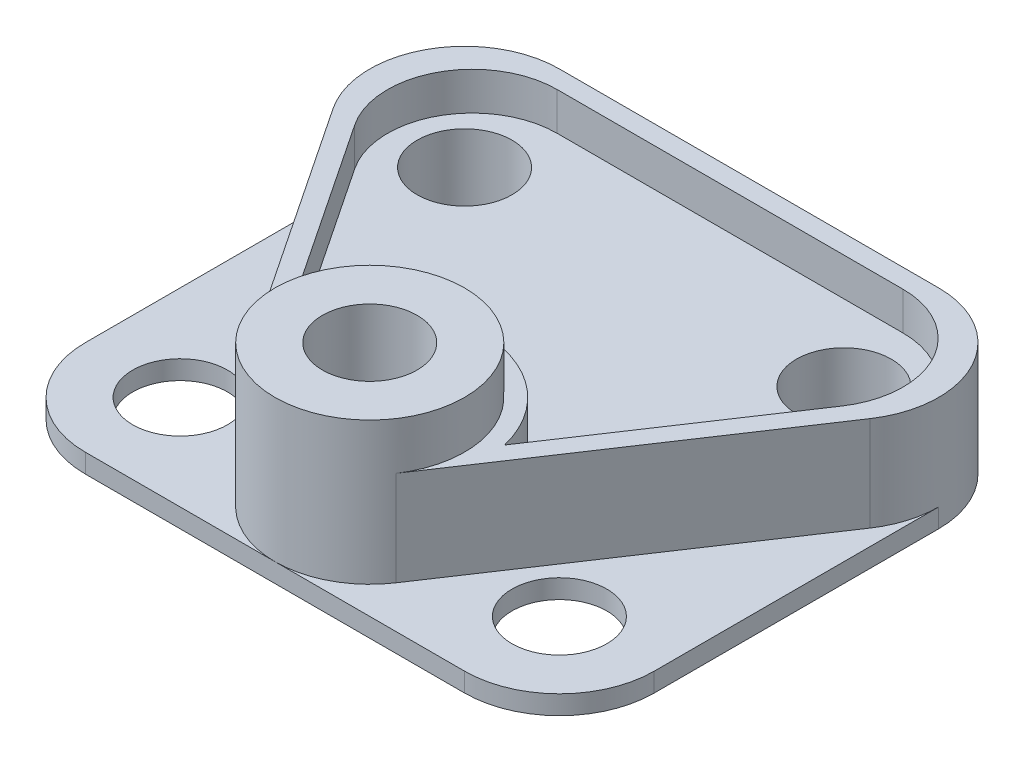
ISO-10303-21;
HEADER;
FILE_DESCRIPTION(('STEP AP214'),'2;1');
FILE_NAME('part.step','',(''),(''),'','','');
FILE_SCHEMA(('AUTOMOTIVE_DESIGN { 1 0 10303 214 1 1 1 1 }'));
ENDSEC;
DATA;
#1=APPLICATION_CONTEXT('core data for automotive mechanical design processes');
#2=APPLICATION_PROTOCOL_DEFINITION('international standard','automotive_design',2000,#1);
#3=PRODUCT_CONTEXT('',#1,'mechanical');
#4=PRODUCT('Part','Part','',(#3));
#5=PRODUCT_RELATED_PRODUCT_CATEGORY('part','',(#4));
#6=PRODUCT_DEFINITION_FORMATION('','',#4);
#7=PRODUCT_DEFINITION_CONTEXT('part definition',#1,'design');
#8=PRODUCT_DEFINITION('design','',#6,#7);
#9=PRODUCT_DEFINITION_SHAPE('','',#8);
#10=(LENGTH_UNIT() NAMED_UNIT(*) SI_UNIT(.MILLI.,.METRE.));
#11=(NAMED_UNIT(*) PLANE_ANGLE_UNIT() SI_UNIT($,.RADIAN.));
#12=(NAMED_UNIT(*) SI_UNIT($,.STERADIAN.) SOLID_ANGLE_UNIT());
#13=UNCERTAINTY_MEASURE_WITH_UNIT(LENGTH_MEASURE(1.E-05),#10,'distance_accuracy_value','');
#14=(GEOMETRIC_REPRESENTATION_CONTEXT(3) GLOBAL_UNCERTAINTY_ASSIGNED_CONTEXT((#13)) GLOBAL_UNIT_ASSIGNED_CONTEXT((#10,
#11,#12)) REPRESENTATION_CONTEXT('',''));
#15=CARTESIAN_POINT('',(0.,0.,0.));
#16=DIRECTION('',(0.,0.,1.));
#17=DIRECTION('',(1.,0.,0.));
#18=AXIS2_PLACEMENT_3D('',#15,#16,#17);
#19=CARTESIAN_POINT('',(12.7,2.54,-50.8));
#20=DIRECTION('',(0.,-1.,0.));
#21=DIRECTION('',(0.,0.,-1.));
#22=AXIS2_PLACEMENT_3D('',#19,#20,#21);
#23=PLANE('',#22);
#24=CARTESIAN_POINT('',(12.7,2.54,-12.7));
#25=DIRECTION('',(0.,1.,0.));
#26=DIRECTION('',(0.,0.,1.));
#27=AXIS2_PLACEMENT_3D('',#24,#25,#26);
#28=CIRCLE('',#27,6.35);
#29=CARTESIAN_POINT('',(12.7,2.54,-6.34999999999999));
#30=VERTEX_POINT('',#29);
#31=EDGE_CURVE('E274',#30,#30,#28,.T.);
#32=ORIENTED_EDGE('',*,*,#31,.F.);
#33=EDGE_LOOP('',(#32));
#34=FACE_BOUND('',#33,.T.);
#35=CARTESIAN_POINT('',(38.1,2.54,-12.7));
#36=DIRECTION('',(0.,1.,0.));
#37=DIRECTION('',(0.,0.,1.));
#38=AXIS2_PLACEMENT_3D('',#35,#36,#37);
#39=CIRCLE('',#38,12.7);
#40=CARTESIAN_POINT('',(27.5329612619094,2.54,-5.65530750793959));
#41=VERTEX_POINT('',#40);
#42=CARTESIAN_POINT('',(38.1,2.54,0.));
#43=VERTEX_POINT('',#42);
#44=EDGE_CURVE('E200',#41,#43,#39,.T.);
#45=ORIENTED_EDGE('',*,*,#44,.F.);
#46=DIRECTION('',(0.554700196225229,0.,0.832050294337844));
#47=VECTOR('',#46,1.);
#48=CARTESIAN_POINT('',(21.6714228003709,2.54,-14.4476152002473));
#49=LINE('',#48,#47);
#50=CARTESIAN_POINT('',(2.13296126190938,2.54,-43.7553075079396));
#51=VERTEX_POINT('',#50);
#52=EDGE_CURVE('E215',#51,#41,#49,.T.);
#53=ORIENTED_EDGE('',*,*,#52,.F.);
#54=CARTESIAN_POINT('',(12.7,2.54,-50.8));
#55=DIRECTION('',(0.,1.,0.));
#56=DIRECTION('',(0.,0.,1.));
#57=AXIS2_PLACEMENT_3D('',#54,#55,#56);
#58=CIRCLE('',#57,12.7);
#59=CARTESIAN_POINT('',(0.,2.54,-50.8));
#60=VERTEX_POINT('',#59);
#61=EDGE_CURVE('E11',#60,#51,#58,.T.);
#62=ORIENTED_EDGE('',*,*,#61,.F.);
#63=DIRECTION('',(0.,0.,1.));
#64=VECTOR('',#63,1.);
#65=CARTESIAN_POINT('',(0.,2.54,-12.7000000000001));
#66=LINE('',#65,#64);
#67=CARTESIAN_POINT('',(0.,2.54,-12.7000000000001));
#68=VERTEX_POINT('',#67);
#69=EDGE_CURVE('E280',#60,#68,#66,.T.);
#70=ORIENTED_EDGE('',*,*,#69,.T.);
#71=CARTESIAN_POINT('',(12.7,2.54,-12.7));
#72=DIRECTION('',(0.,1.,0.));
#73=DIRECTION('',(0.,0.,-1.));
#74=AXIS2_PLACEMENT_3D('',#71,#72,#73);
#75=CIRCLE('',#74,12.7);
#76=CARTESIAN_POINT('',(12.7000000000001,2.54,0.));
#77=VERTEX_POINT('',#76);
#78=EDGE_CURVE('E282',#68,#77,#75,.T.);
#79=ORIENTED_EDGE('',*,*,#78,.T.);
#80=DIRECTION('',(1.,0.,0.));
#81=VECTOR('',#80,1.);
#82=CARTESIAN_POINT('',(12.7000000000001,2.54,0.));
#83=LINE('',#82,#81);
#84=EDGE_CURVE('E286',#77,#43,#83,.T.);
#85=ORIENTED_EDGE('',*,*,#84,.T.);
#86=EDGE_LOOP('',(#45,#53,#62,#70,#79,#85));
#87=FACE_BOUND('',#86,.T.);
#88=ADVANCED_FACE('F39',(#34,#87),#23,.F.);
#89=CARTESIAN_POINT('',(63.5,2.54,-12.7));
#90=DIRECTION('',(0.,1.,0.));
#91=DIRECTION('',(0.,0.,1.));
#92=AXIS2_PLACEMENT_3D('',#89,#90,#91);
#93=CIRCLE('',#92,6.35);
#94=CARTESIAN_POINT('',(63.5,2.54,-6.35));
#95=VERTEX_POINT('',#94);
#96=EDGE_CURVE('E268',#95,#95,#93,.T.);
#97=ORIENTED_EDGE('',*,*,#96,.F.);
#98=EDGE_LOOP('',(#97));
#99=FACE_BOUND('',#98,.T.);
#100=CARTESIAN_POINT('',(48.6670387380906,2.54,-5.65530750793959));
#101=VERTEX_POINT('',#100);
#102=EDGE_CURVE('E205',#43,#101,#39,.T.);
#103=ORIENTED_EDGE('',*,*,#102,.F.);
#104=CARTESIAN_POINT('',(63.4999999999999,2.54,0.));
#105=VERTEX_POINT('',#104);
#106=EDGE_CURVE('E285',#43,#105,#83,.T.);
#107=ORIENTED_EDGE('',*,*,#106,.T.);
#108=CARTESIAN_POINT('',(63.5,2.54,-12.7));
#109=DIRECTION('',(0.,1.,0.));
#110=DIRECTION('',(0.,0.,1.));
#111=AXIS2_PLACEMENT_3D('',#108,#109,#110);
#112=CIRCLE('',#111,12.7);
#113=CARTESIAN_POINT('',(76.2,2.54,-12.7000000000001));
#114=VERTEX_POINT('',#113);
#115=EDGE_CURVE('E289',#105,#114,#112,.T.);
#116=ORIENTED_EDGE('',*,*,#115,.T.);
#117=DIRECTION('',(0.,0.,-1.));
#118=VECTOR('',#117,1.);
#119=CARTESIAN_POINT('',(76.2,2.54,-12.7000000000001));
#120=LINE('',#119,#118);
#121=CARTESIAN_POINT('',(76.2,2.54,-50.8));
#122=VERTEX_POINT('',#121);
#123=EDGE_CURVE('E291',#114,#122,#120,.T.);
#124=ORIENTED_EDGE('',*,*,#123,.T.);
#125=CARTESIAN_POINT('',(63.5,2.54,-50.8));
#126=DIRECTION('',(0.,1.,0.));
#127=DIRECTION('',(0.,0.,1.));
#128=AXIS2_PLACEMENT_3D('',#125,#126,#127);
#129=CIRCLE('',#128,12.7);
#130=CARTESIAN_POINT('',(74.0670387380906,2.54,-43.7553075079396));
#131=VERTEX_POINT('',#130);
#132=EDGE_CURVE('E245',#131,#122,#129,.T.);
#133=ORIENTED_EDGE('',*,*,#132,.F.);
#134=DIRECTION('',(-0.554700196225229,0.,0.832050294337844));
#135=VECTOR('',#134,1.);
#136=CARTESIAN_POINT('',(31.0824233534752,2.54,20.7216155689835));
#137=LINE('',#136,#135);
#138=EDGE_CURVE('E208',#131,#101,#137,.T.);
#139=ORIENTED_EDGE('',*,*,#138,.T.);
#140=EDGE_LOOP('',(#103,#107,#116,#124,#133,#139));
#141=FACE_BOUND('',#140,.T.);
#142=ADVANCED_FACE('F363',(#99,#141),#23,.F.);
#143=CARTESIAN_POINT('',(12.7,0.,-50.8));
#144=DIRECTION('',(0.,-1.,0.));
#145=DIRECTION('',(0.,0.,-1.));
#146=AXIS2_PLACEMENT_3D('',#143,#144,#145);
#147=PLANE('',#146);
#148=CARTESIAN_POINT('',(12.7,0.,-50.8));
#149=DIRECTION('',(0.,-1.,0.));
#150=DIRECTION('',(0.,0.,-1.));
#151=AXIS2_PLACEMENT_3D('',#148,#149,#150);
#152=CIRCLE('',#151,6.35);
#153=CARTESIAN_POINT('',(12.7,0.,-57.15));
#154=VERTEX_POINT('',#153);
#155=EDGE_CURVE('E43',#154,#154,#152,.T.);
#156=ORIENTED_EDGE('',*,*,#155,.F.);
#157=EDGE_LOOP('',(#156));
#158=FACE_BOUND('',#157,.T.);
#159=CARTESIAN_POINT('',(63.5,0.,-50.8));
#160=DIRECTION('',(0.,-1.,0.));
#161=DIRECTION('',(0.,0.,-1.));
#162=AXIS2_PLACEMENT_3D('',#159,#160,#161);
#163=CIRCLE('',#162,6.35);
#164=CARTESIAN_POINT('',(63.5,0.,-57.15));
#165=VERTEX_POINT('',#164);
#166=EDGE_CURVE('E334',#165,#165,#163,.T.);
#167=ORIENTED_EDGE('',*,*,#166,.F.);
#168=EDGE_LOOP('',(#167));
#169=FACE_BOUND('',#168,.T.);
#170=CARTESIAN_POINT('',(38.1,0.,-12.7));
#171=DIRECTION('',(0.,-1.,0.));
#172=DIRECTION('',(0.,0.,-1.));
#173=AXIS2_PLACEMENT_3D('',#170,#171,#172);
#174=CIRCLE('',#173,6.35);
#175=CARTESIAN_POINT('',(38.1,0.,-19.05));
#176=VERTEX_POINT('',#175);
#177=EDGE_CURVE('E332',#176,#176,#174,.T.);
#178=ORIENTED_EDGE('',*,*,#177,.F.);
#179=EDGE_LOOP('',(#178));
#180=FACE_BOUND('',#179,.T.);
#181=CARTESIAN_POINT('',(12.7,0.,-12.7));
#182=DIRECTION('',(0.,1.,0.));
#183=DIRECTION('',(0.,0.,1.));
#184=AXIS2_PLACEMENT_3D('',#181,#182,#183);
#185=CIRCLE('',#184,6.35);
#186=CARTESIAN_POINT('',(12.7,0.,-6.34999999999999));
#187=VERTEX_POINT('',#186);
#188=EDGE_CURVE('E271',#187,#187,#185,.T.);
#189=ORIENTED_EDGE('',*,*,#188,.T.);
#190=EDGE_LOOP('',(#189));
#191=FACE_BOUND('',#190,.T.);
#192=CARTESIAN_POINT('',(12.7,0.,-50.8));
#193=DIRECTION('',(0.,1.,0.));
#194=DIRECTION('',(0.,0.,-1.));
#195=AXIS2_PLACEMENT_3D('',#192,#193,#194);
#196=CIRCLE('',#195,12.7);
#197=CARTESIAN_POINT('',(12.7000000000001,0.,-63.5));
#198=VERTEX_POINT('',#197);
#199=CARTESIAN_POINT('',(0.,0.,-50.7999999999999));
#200=VERTEX_POINT('',#199);
#201=EDGE_CURVE('E277',#198,#200,#196,.T.);
#202=ORIENTED_EDGE('',*,*,#201,.F.);
#203=DIRECTION('',(-1.,0.,0.));
#204=VECTOR('',#203,1.);
#205=CARTESIAN_POINT('',(12.7000000000001,0.,-63.5));
#206=LINE('',#205,#204);
#207=CARTESIAN_POINT('',(63.4999999999999,0.,-63.5));
#208=VERTEX_POINT('',#207);
#209=EDGE_CURVE('E283',#208,#198,#206,.T.);
#210=ORIENTED_EDGE('',*,*,#209,.F.);
#211=CARTESIAN_POINT('',(63.5,0.,-50.8));
#212=DIRECTION('',(0.,1.,0.));
#213=DIRECTION('',(0.,0.,-1.));
#214=AXIS2_PLACEMENT_3D('',#211,#212,#213);
#215=CIRCLE('',#214,12.7);
#216=CARTESIAN_POINT('',(76.2,0.,-50.7999999999999));
#217=VERTEX_POINT('',#216);
#218=EDGE_CURVE('E307',#217,#208,#215,.T.);
#219=ORIENTED_EDGE('',*,*,#218,.F.);
#220=DIRECTION('',(0.,0.,-1.));
#221=VECTOR('',#220,1.);
#222=CARTESIAN_POINT('',(76.2,0.,-12.7000000000001));
#223=LINE('',#222,#221);
#224=CARTESIAN_POINT('',(76.2,0.,-12.7000000000001));
#225=VERTEX_POINT('',#224);
#226=EDGE_CURVE('E305',#225,#217,#223,.T.);
#227=ORIENTED_EDGE('',*,*,#226,.F.);
#228=CARTESIAN_POINT('',(63.5,0.,-12.7));
#229=DIRECTION('',(0.,1.,0.));
#230=DIRECTION('',(0.,0.,1.));
#231=AXIS2_PLACEMENT_3D('',#228,#229,#230);
#232=CIRCLE('',#231,12.7);
#233=CARTESIAN_POINT('',(63.4999999999999,0.,0.));
#234=VERTEX_POINT('',#233);
#235=EDGE_CURVE('E303',#234,#225,#232,.T.);
#236=ORIENTED_EDGE('',*,*,#235,.F.);
#237=DIRECTION('',(1.,0.,0.));
#238=VECTOR('',#237,1.);
#239=CARTESIAN_POINT('',(12.7000000000001,0.,0.));
#240=LINE('',#239,#238);
#241=CARTESIAN_POINT('',(12.7000000000001,0.,0.));
#242=VERTEX_POINT('',#241);
#243=EDGE_CURVE('E301',#242,#234,#240,.T.);
#244=ORIENTED_EDGE('',*,*,#243,.F.);
#245=CARTESIAN_POINT('',(12.7,0.,-12.7));
#246=DIRECTION('',(0.,1.,0.));
#247=DIRECTION('',(0.,0.,-1.));
#248=AXIS2_PLACEMENT_3D('',#245,#246,#247);
#249=CIRCLE('',#248,12.7);
#250=CARTESIAN_POINT('',(0.,0.,-12.7000000000001));
#251=VERTEX_POINT('',#250);
#252=EDGE_CURVE('E299',#251,#242,#249,.T.);
#253=ORIENTED_EDGE('',*,*,#252,.F.);
#254=DIRECTION('',(0.,0.,1.));
#255=VECTOR('',#254,1.);
#256=CARTESIAN_POINT('',(0.,0.,-12.7000000000001));
#257=LINE('',#256,#255);
#258=EDGE_CURVE('E297',#200,#251,#257,.T.);
#259=ORIENTED_EDGE('',*,*,#258,.F.);
#260=EDGE_LOOP('',(#202,#210,#219,#227,#236,#244,#253,#259));
#261=FACE_BOUND('',#260,.T.);
#262=CARTESIAN_POINT('',(63.5,0.,-12.7));
#263=DIRECTION('',(0.,1.,0.));
#264=DIRECTION('',(0.,0.,1.));
#265=AXIS2_PLACEMENT_3D('',#262,#263,#264);
#266=CIRCLE('',#265,6.35);
#267=CARTESIAN_POINT('',(63.5,0.,-6.35));
#268=VERTEX_POINT('',#267);
#269=EDGE_CURVE('E259',#268,#268,#266,.T.);
#270=ORIENTED_EDGE('',*,*,#269,.T.);
#271=EDGE_LOOP('',(#270));
#272=FACE_BOUND('',#271,.T.);
#273=ADVANCED_FACE('F369',(#158,#169,#180,#191,#261,#272),#147,.T.);
#274=CARTESIAN_POINT('',(12.7,2.54,-50.8));
#275=DIRECTION('',(0.,-1.,0.));
#276=DIRECTION('',(0.,0.,-1.));
#277=AXIS2_PLACEMENT_3D('',#274,#275,#276);
#278=CYLINDRICAL_SURFACE('',#277,12.7);
#279=ORIENTED_EDGE('',*,*,#201,.T.);
#280=DIRECTION('',(0.,-1.,0.));
#281=VECTOR('',#280,1.);
#282=CARTESIAN_POINT('',(0.,2.54,-50.7999999999999));
#283=LINE('',#282,#281);
#284=EDGE_CURVE('E48',#60,#200,#283,.T.);
#285=ORIENTED_EDGE('',*,*,#284,.F.);
#286=ORIENTED_EDGE('',*,*,#61,.T.);
#287=DIRECTION('',(0.,-1.,0.));
#288=VECTOR('',#287,1.);
#289=CARTESIAN_POINT('',(2.13296126190938,15.24,-43.7553075079396));
#290=LINE('',#289,#288);
#291=CARTESIAN_POINT('',(2.13296126190938,15.24,-43.7553075079396));
#292=VERTEX_POINT('',#291);
#293=EDGE_CURVE('E262',#292,#51,#290,.T.);
#294=ORIENTED_EDGE('',*,*,#293,.F.);
#295=CARTESIAN_POINT('',(12.7,15.24,-50.8));
#296=DIRECTION('',(0.,1.,0.));
#297=DIRECTION('',(0.,0.,1.));
#298=AXIS2_PLACEMENT_3D('',#295,#296,#297);
#299=CIRCLE('',#298,12.7);
#300=CARTESIAN_POINT('',(12.7000000000001,15.24,-63.5));
#301=VERTEX_POINT('',#300);
#302=EDGE_CURVE('E224',#301,#292,#299,.T.);
#303=ORIENTED_EDGE('',*,*,#302,.F.);
#304=DIRECTION('',(0.,-1.,0.));
#305=VECTOR('',#304,1.);
#306=CARTESIAN_POINT('',(12.7000000000001,2.54,-63.5));
#307=LINE('',#306,#305);
#308=EDGE_CURVE('E294',#301,#198,#307,.T.);
#309=ORIENTED_EDGE('',*,*,#308,.T.);
#310=EDGE_LOOP('',(#279,#285,#286,#294,#303,#309));
#311=FACE_BOUND('',#310,.T.);
#312=ADVANCED_FACE('F41',(#311),#278,.T.);
#313=CARTESIAN_POINT('',(0.,2.54,-12.7000000000001));
#314=DIRECTION('',(1.,0.,0.));
#315=DIRECTION('',(0.,0.,-1.));
#316=AXIS2_PLACEMENT_3D('',#313,#314,#315);
#317=PLANE('',#316);
#318=ORIENTED_EDGE('',*,*,#258,.T.);
#319=DIRECTION('',(0.,-1.,0.));
#320=VECTOR('',#319,1.);
#321=CARTESIAN_POINT('',(0.,2.54,-12.7000000000001));
#322=LINE('',#321,#320);
#323=EDGE_CURVE('E327',#68,#251,#322,.T.);
#324=ORIENTED_EDGE('',*,*,#323,.F.);
#325=ORIENTED_EDGE('',*,*,#69,.F.);
#326=ORIENTED_EDGE('',*,*,#284,.T.);
#327=EDGE_LOOP('',(#318,#324,#325,#326));
#328=FACE_BOUND('',#327,.T.);
#329=ADVANCED_FACE('F402',(#328),#317,.F.);
#330=CARTESIAN_POINT('',(12.7,2.54,-12.7));
#331=DIRECTION('',(0.,-1.,0.));
#332=DIRECTION('',(0.,0.,-1.));
#333=AXIS2_PLACEMENT_3D('',#330,#331,#332);
#334=CYLINDRICAL_SURFACE('',#333,12.7);
#335=ORIENTED_EDGE('',*,*,#252,.T.);
#336=DIRECTION('',(0.,-1.,0.));
#337=VECTOR('',#336,1.);
#338=CARTESIAN_POINT('',(12.7000000000001,2.54,0.));
#339=LINE('',#338,#337);
#340=EDGE_CURVE('E324',#77,#242,#339,.T.);
#341=ORIENTED_EDGE('',*,*,#340,.F.);
#342=ORIENTED_EDGE('',*,*,#78,.F.);
#343=ORIENTED_EDGE('',*,*,#323,.T.);
#344=EDGE_LOOP('',(#335,#341,#342,#343));
#345=FACE_BOUND('',#344,.T.);
#346=ADVANCED_FACE('F399',(#345),#334,.T.);
#347=CARTESIAN_POINT('',(12.7000000000001,2.54,0.));
#348=DIRECTION('',(0.,0.,-1.));
#349=DIRECTION('',(-1.,0.,0.));
#350=AXIS2_PLACEMENT_3D('',#347,#348,#349);
#351=PLANE('',#350);
#352=ORIENTED_EDGE('',*,*,#243,.T.);
#353=DIRECTION('',(0.,-1.,0.));
#354=VECTOR('',#353,1.);
#355=CARTESIAN_POINT('',(63.4999999999999,2.54,0.));
#356=LINE('',#355,#354);
#357=EDGE_CURVE('E321',#105,#234,#356,.T.);
#358=ORIENTED_EDGE('',*,*,#357,.F.);
#359=ORIENTED_EDGE('',*,*,#106,.F.);
#360=ORIENTED_EDGE('',*,*,#84,.F.);
#361=ORIENTED_EDGE('',*,*,#340,.T.);
#362=EDGE_LOOP('',(#352,#358,#359,#360,#361));
#363=FACE_BOUND('',#362,.T.);
#364=ADVANCED_FACE('F395',(#363),#351,.F.);
#365=CARTESIAN_POINT('',(63.5,2.54,-12.7));
#366=DIRECTION('',(0.,-1.,0.));
#367=DIRECTION('',(0.,0.,-1.));
#368=AXIS2_PLACEMENT_3D('',#365,#366,#367);
#369=CYLINDRICAL_SURFACE('',#368,12.7);
#370=ORIENTED_EDGE('',*,*,#235,.T.);
#371=DIRECTION('',(0.,-1.,0.));
#372=VECTOR('',#371,1.);
#373=CARTESIAN_POINT('',(76.2,2.54,-12.7000000000001));
#374=LINE('',#373,#372);
#375=EDGE_CURVE('E318',#114,#225,#374,.T.);
#376=ORIENTED_EDGE('',*,*,#375,.F.);
#377=ORIENTED_EDGE('',*,*,#115,.F.);
#378=ORIENTED_EDGE('',*,*,#357,.T.);
#379=EDGE_LOOP('',(#370,#376,#377,#378));
#380=FACE_BOUND('',#379,.T.);
#381=ADVANCED_FACE('F391',(#380),#369,.T.);
#382=CARTESIAN_POINT('',(76.2,2.54,-12.7000000000001));
#383=DIRECTION('',(-1.,0.,0.));
#384=DIRECTION('',(0.,0.,1.));
#385=AXIS2_PLACEMENT_3D('',#382,#383,#384);
#386=PLANE('',#385);
#387=ORIENTED_EDGE('',*,*,#226,.T.);
#388=DIRECTION('',(0.,-1.,0.));
#389=VECTOR('',#388,1.);
#390=CARTESIAN_POINT('',(76.2,2.54,-50.7999999999999));
#391=LINE('',#390,#389);
#392=EDGE_CURVE('E315',#122,#217,#391,.T.);
#393=ORIENTED_EDGE('',*,*,#392,.F.);
#394=ORIENTED_EDGE('',*,*,#123,.F.);
#395=ORIENTED_EDGE('',*,*,#375,.T.);
#396=EDGE_LOOP('',(#387,#393,#394,#395));
#397=FACE_BOUND('',#396,.T.);
#398=ADVANCED_FACE('F387',(#397),#386,.F.);
#399=CARTESIAN_POINT('',(63.5,2.54,-50.8));
#400=DIRECTION('',(0.,-1.,0.));
#401=DIRECTION('',(0.,0.,-1.));
#402=AXIS2_PLACEMENT_3D('',#399,#400,#401);
#403=CYLINDRICAL_SURFACE('',#402,12.7);
#404=ORIENTED_EDGE('',*,*,#218,.T.);
#405=DIRECTION('',(0.,-1.,0.));
#406=VECTOR('',#405,1.);
#407=CARTESIAN_POINT('',(63.4999999999999,2.54,-63.5));
#408=LINE('',#407,#406);
#409=CARTESIAN_POINT('',(63.4999999999999,15.24,-63.5));
#410=VERTEX_POINT('',#409);
#411=EDGE_CURVE('E312',#410,#208,#408,.T.);
#412=ORIENTED_EDGE('',*,*,#411,.F.);
#413=CARTESIAN_POINT('',(63.5,15.24,-50.8));
#414=DIRECTION('',(0.,1.,0.));
#415=DIRECTION('',(0.,0.,1.));
#416=AXIS2_PLACEMENT_3D('',#413,#414,#415);
#417=CIRCLE('',#416,12.7);
#418=CARTESIAN_POINT('',(74.0670387380906,15.24,-43.7553075079396));
#419=VERTEX_POINT('',#418);
#420=EDGE_CURVE('E218',#419,#410,#417,.T.);
#421=ORIENTED_EDGE('',*,*,#420,.F.);
#422=DIRECTION('',(0.,-1.,0.));
#423=VECTOR('',#422,1.);
#424=CARTESIAN_POINT('',(74.0670387380906,15.24,-43.7553075079396));
#425=LINE('',#424,#423);
#426=EDGE_CURVE('E265',#419,#131,#425,.T.);
#427=ORIENTED_EDGE('',*,*,#426,.T.);
#428=ORIENTED_EDGE('',*,*,#132,.T.);
#429=ORIENTED_EDGE('',*,*,#392,.T.);
#430=EDGE_LOOP('',(#404,#412,#421,#427,#428,#429));
#431=FACE_BOUND('',#430,.T.);
#432=ADVANCED_FACE('F383',(#431),#403,.T.);
#433=CARTESIAN_POINT('',(12.7000000000001,2.54,-63.5));
#434=DIRECTION('',(0.,0.,1.));
#435=DIRECTION('',(1.,0.,0.));
#436=AXIS2_PLACEMENT_3D('',#433,#434,#435);
#437=PLANE('',#436);
#438=ORIENTED_EDGE('',*,*,#209,.T.);
#439=ORIENTED_EDGE('',*,*,#308,.F.);
#440=DIRECTION('',(-1.,0.,0.));
#441=VECTOR('',#440,1.);
#442=CARTESIAN_POINT('',(0.,15.24,-63.5));
#443=LINE('',#442,#441);
#444=EDGE_CURVE('E221',#410,#301,#443,.T.);
#445=ORIENTED_EDGE('',*,*,#444,.F.);
#446=ORIENTED_EDGE('',*,*,#411,.T.);
#447=EDGE_LOOP('',(#438,#439,#445,#446));
#448=FACE_BOUND('',#447,.T.);
#449=ADVANCED_FACE('F380',(#448),#437,.F.);
#450=CARTESIAN_POINT('',(12.7,2.54,-12.7));
#451=DIRECTION('',(0.,-1.,0.));
#452=DIRECTION('',(0.,0.,-1.));
#453=AXIS2_PLACEMENT_3D('',#450,#451,#452);
#454=CYLINDRICAL_SURFACE('',#453,6.35);
#455=ORIENTED_EDGE('',*,*,#31,.T.);
#456=EDGE_LOOP('',(#455));
#457=FACE_BOUND('',#456,.T.);
#458=ORIENTED_EDGE('',*,*,#188,.F.);
#459=EDGE_LOOP('',(#458));
#460=FACE_BOUND('',#459,.T.);
#461=ADVANCED_FACE('F375',(#457,#460),#454,.F.);
#462=CARTESIAN_POINT('',(63.5,2.54,-12.7));
#463=DIRECTION('',(0.,-1.,0.));
#464=DIRECTION('',(0.,0.,-1.));
#465=AXIS2_PLACEMENT_3D('',#462,#463,#464);
#466=CYLINDRICAL_SURFACE('',#465,6.35);
#467=ORIENTED_EDGE('',*,*,#96,.T.);
#468=EDGE_LOOP('',(#467));
#469=FACE_BOUND('',#468,.T.);
#470=ORIENTED_EDGE('',*,*,#269,.F.);
#471=EDGE_LOOP('',(#470));
#472=FACE_BOUND('',#471,.T.);
#473=ADVANCED_FACE('F462',(#469,#472),#466,.F.);
#474=CARTESIAN_POINT('',(0.,15.24,-60.96));
#475=DIRECTION('',(0.,0.,1.));
#476=DIRECTION('',(1.,0.,0.));
#477=AXIS2_PLACEMENT_3D('',#474,#475,#476);
#478=PLANE('',#477);
#479=DIRECTION('',(-1.,0.,0.));
#480=VECTOR('',#479,1.);
#481=CARTESIAN_POINT('',(0.,10.16,-60.96));
#482=LINE('',#481,#480);
#483=CARTESIAN_POINT('',(61.2605465191294,10.16,-60.96));
#484=VERTEX_POINT('',#483);
#485=CARTESIAN_POINT('',(14.9394534808706,10.16,-60.96));
#486=VERTEX_POINT('',#485);
#487=EDGE_CURVE('E56',#484,#486,#482,.T.);
#488=ORIENTED_EDGE('',*,*,#487,.F.);
#489=DIRECTION('',(0.,-1.,0.));
#490=VECTOR('',#489,1.);
#491=CARTESIAN_POINT('',(61.2605465191294,15.24,-60.96));
#492=LINE('',#491,#490);
#493=CARTESIAN_POINT('',(61.2605465191294,15.24,-60.96));
#494=VERTEX_POINT('',#493);
#495=EDGE_CURVE('E257',#494,#484,#492,.T.);
#496=ORIENTED_EDGE('',*,*,#495,.F.);
#497=DIRECTION('',(-1.,0.,0.));
#498=VECTOR('',#497,1.);
#499=CARTESIAN_POINT('',(0.,15.24,-60.96));
#500=LINE('',#499,#498);
#501=CARTESIAN_POINT('',(14.9394534808706,15.24,-60.96));
#502=VERTEX_POINT('',#501);
#503=EDGE_CURVE('E229',#494,#502,#500,.T.);
#504=ORIENTED_EDGE('',*,*,#503,.T.);
#505=DIRECTION('',(0.,-1.,0.));
#506=VECTOR('',#505,1.);
#507=CARTESIAN_POINT('',(14.9394534808706,15.24,-60.96));
#508=LINE('',#507,#506);
#509=EDGE_CURVE('E180',#502,#486,#508,.T.);
#510=ORIENTED_EDGE('',*,*,#509,.T.);
#511=EDGE_LOOP('',(#488,#496,#504,#510));
#512=FACE_BOUND('',#511,.T.);
#513=ADVANCED_FACE('F464',(#512),#478,.T.);
#514=CARTESIAN_POINT('',(61.2605465191294,15.24,-49.6014808691487));
#515=DIRECTION('',(0.,-1.,0.));
#516=DIRECTION('',(0.,0.,-1.));
#517=AXIS2_PLACEMENT_3D('',#514,#515,#516);
#518=CYLINDRICAL_SURFACE('',#517,11.3585191308513);
#519=ORIENTED_EDGE('',*,*,#495,.T.);
#520=CARTESIAN_POINT('',(61.2605465191294,10.16,-49.6014808691487));
#521=DIRECTION('',(0.,1.,0.));
#522=DIRECTION('',(0.,0.,1.));
#523=AXIS2_PLACEMENT_3D('',#520,#521,#522);
#524=CIRCLE('',#523,11.3585191308513);
#525=CARTESIAN_POINT('',(70.7114057051963,10.16,-43.3009080784374));
#526=VERTEX_POINT('',#525);
#527=EDGE_CURVE('E63',#484,#526,#524,.F.);
#528=ORIENTED_EDGE('',*,*,#527,.T.);
#529=DIRECTION('',(0.,-1.,0.));
#530=VECTOR('',#529,1.);
#531=CARTESIAN_POINT('',(70.7114057051963,15.24,-43.3009080784374));
#532=LINE('',#531,#530);
#533=CARTESIAN_POINT('',(70.7114057051963,15.24,-43.3009080784374));
#534=VERTEX_POINT('',#533);
#535=EDGE_CURVE('E255',#534,#526,#532,.T.);
#536=ORIENTED_EDGE('',*,*,#535,.F.);
#537=CARTESIAN_POINT('',(61.2605465191294,15.24,-49.6014808691487));
#538=DIRECTION('',(0.,1.,0.));
#539=DIRECTION('',(0.,0.,1.));
#540=AXIS2_PLACEMENT_3D('',#537,#538,#539);
#541=CIRCLE('',#540,11.3585191308513);
#542=EDGE_CURVE('E232',#494,#534,#541,.F.);
#543=ORIENTED_EDGE('',*,*,#542,.F.);
#544=EDGE_LOOP('',(#519,#528,#536,#543));
#545=FACE_BOUND('',#544,.T.);
#546=ADVANCED_FACE('F470',(#545),#518,.F.);
#547=CARTESIAN_POINT('',(28.9690156058571,15.24,19.3126770705714));
#548=DIRECTION('',(-0.832050294337844,0.,-0.554700196225229));
#549=DIRECTION('',(-0.554700196225229,0.,0.832050294337844));
#550=AXIS2_PLACEMENT_3D('',#547,#548,#549);
#551=PLANE('',#550);
#552=DIRECTION('',(0.554700196225229,0.,-0.832050294337844));
#553=VECTOR('',#552,1.);
#554=CARTESIAN_POINT('',(28.9690156058571,10.16,19.3126770705714));
#555=LINE('',#554,#553);
#556=CARTESIAN_POINT('',(52.6468960120614,10.16,-16.204143538735));
#557=VERTEX_POINT('',#556);
#558=EDGE_CURVE('E197',#557,#526,#555,.T.);
#559=ORIENTED_EDGE('',*,*,#558,.F.);
#560=DIRECTION('',(0.,-1.,0.));
#561=VECTOR('',#560,1.);
#562=CARTESIAN_POINT('',(52.6468960120614,15.24,-16.204143538735));
#563=LINE('',#562,#561);
#564=CARTESIAN_POINT('',(52.6468960120614,15.24,-16.204143538735));
#565=VERTEX_POINT('',#564);
#566=EDGE_CURVE('E252',#565,#557,#563,.T.);
#567=ORIENTED_EDGE('',*,*,#566,.F.);
#568=DIRECTION('',(0.554700196225229,0.,-0.832050294337844));
#569=VECTOR('',#568,1.);
#570=CARTESIAN_POINT('',(28.9690156058571,15.24,19.3126770705714));
#571=LINE('',#570,#569);
#572=EDGE_CURVE('E234',#565,#534,#571,.T.);
#573=ORIENTED_EDGE('',*,*,#572,.T.);
#574=ORIENTED_EDGE('',*,*,#535,.T.);
#575=EDGE_LOOP('',(#559,#567,#573,#574));
#576=FACE_BOUND('',#575,.T.);
#577=ADVANCED_FACE('F635',(#576),#551,.T.);
#578=CARTESIAN_POINT('',(38.1,15.24,-12.7));
#579=DIRECTION('',(0.,-1.,0.));
#580=DIRECTION('',(0.,0.,-1.));
#581=AXIS2_PLACEMENT_3D('',#578,#579,#580);
#582=CYLINDRICAL_SURFACE('',#581,14.9629945373841);
#583=ORIENTED_EDGE('',*,*,#566,.T.);
#584=CARTESIAN_POINT('',(38.1,10.16,-12.7));
#585=DIRECTION('',(0.,1.,0.));
#586=DIRECTION('',(0.,0.,1.));
#587=AXIS2_PLACEMENT_3D('',#584,#585,#586);
#588=CIRCLE('',#587,14.9629945373841);
#589=CARTESIAN_POINT('',(23.5531039879386,10.16,-16.204143538735));
#590=VERTEX_POINT('',#589);
#591=EDGE_CURVE('E189',#557,#590,#588,.T.);
#592=ORIENTED_EDGE('',*,*,#591,.T.);
#593=DIRECTION('',(0.,-1.,0.));
#594=VECTOR('',#593,1.);
#595=CARTESIAN_POINT('',(23.5531039879386,15.24,-16.204143538735));
#596=LINE('',#595,#594);
#597=CARTESIAN_POINT('',(23.5531039879386,15.24,-16.204143538735));
#598=VERTEX_POINT('',#597);
#599=EDGE_CURVE('E179',#598,#590,#596,.T.);
#600=ORIENTED_EDGE('',*,*,#599,.F.);
#601=CARTESIAN_POINT('',(38.1,15.24,-12.7));
#602=DIRECTION('',(0.,1.,0.));
#603=DIRECTION('',(0.,0.,1.));
#604=AXIS2_PLACEMENT_3D('',#601,#602,#603);
#605=CIRCLE('',#604,14.9629945373841);
#606=EDGE_CURVE('E237',#565,#598,#605,.T.);
#607=ORIENTED_EDGE('',*,*,#606,.F.);
#608=EDGE_LOOP('',(#583,#592,#600,#607));
#609=FACE_BOUND('',#608,.T.);
#610=ADVANCED_FACE('F459',(#609),#582,.T.);
#611=CARTESIAN_POINT('',(23.784830547989,15.24,-15.8565536986594));
#612=DIRECTION('',(0.832050294337844,0.,-0.554700196225229));
#613=DIRECTION('',(-0.554700196225229,0.,-0.832050294337844));
#614=AXIS2_PLACEMENT_3D('',#611,#612,#613);
#615=PLANE('',#614);
#616=DIRECTION('',(0.554700196225229,0.,0.832050294337844));
#617=VECTOR('',#616,1.);
#618=CARTESIAN_POINT('',(23.784830547989,10.16,-15.8565536986594));
#619=LINE('',#618,#617);
#620=CARTESIAN_POINT('',(5.4885942948037,10.16,-43.3009080784374));
#621=VERTEX_POINT('',#620);
#622=EDGE_CURVE('E184',#621,#590,#619,.T.);
#623=ORIENTED_EDGE('',*,*,#622,.F.);
#624=DIRECTION('',(0.,-1.,0.));
#625=VECTOR('',#624,1.);
#626=CARTESIAN_POINT('',(5.4885942948037,15.24,-43.3009080784374));
#627=LINE('',#626,#625);
#628=CARTESIAN_POINT('',(5.4885942948037,15.24,-43.3009080784374));
#629=VERTEX_POINT('',#628);
#630=EDGE_CURVE('E169',#629,#621,#627,.T.);
#631=ORIENTED_EDGE('',*,*,#630,.F.);
#632=DIRECTION('',(0.554700196225229,0.,0.832050294337844));
#633=VECTOR('',#632,1.);
#634=CARTESIAN_POINT('',(23.784830547989,15.24,-15.8565536986594));
#635=LINE('',#634,#633);
#636=EDGE_CURVE('E239',#629,#598,#635,.T.);
#637=ORIENTED_EDGE('',*,*,#636,.T.);
#638=ORIENTED_EDGE('',*,*,#599,.T.);
#639=EDGE_LOOP('',(#623,#631,#637,#638));
#640=FACE_BOUND('',#639,.T.);
#641=ADVANCED_FACE('F185',(#640),#615,.T.);
#642=CARTESIAN_POINT('',(31.0824233534752,15.24,20.7216155689835));
#643=DIRECTION('',(0.832050294337844,0.,0.554700196225229));
#644=DIRECTION('',(0.554700196225229,0.,-0.832050294337844));
#645=AXIS2_PLACEMENT_3D('',#642,#643,#644);
#646=PLANE('',#645);
#647=ORIENTED_EDGE('',*,*,#138,.F.);
#648=ORIENTED_EDGE('',*,*,#426,.F.);
#649=DIRECTION('',(-0.554700196225229,0.,0.832050294337844));
#650=VECTOR('',#649,1.);
#651=CARTESIAN_POINT('',(31.0824233534752,15.24,20.7216155689835));
#652=LINE('',#651,#650);
#653=CARTESIAN_POINT('',(48.6670387380906,15.24,-5.65530750793959));
#654=VERTEX_POINT('',#653);
#655=EDGE_CURVE('E214',#419,#654,#652,.T.);
#656=ORIENTED_EDGE('',*,*,#655,.T.);
#657=DIRECTION('',(0.,-1.,0.));
#658=VECTOR('',#657,1.);
#659=CARTESIAN_POINT('',(48.6670387380906,15.24,-5.65530750793959));
#660=LINE('',#659,#658);
#661=EDGE_CURVE('E249',#654,#101,#660,.T.);
#662=ORIENTED_EDGE('',*,*,#661,.T.);
#663=EDGE_LOOP('',(#647,#648,#656,#662));
#664=FACE_BOUND('',#663,.T.);
#665=ADVANCED_FACE('F451',(#664),#646,.T.);
#666=CARTESIAN_POINT('',(21.6714228003709,15.24,-14.4476152002473));
#667=DIRECTION('',(0.832050294337844,0.,-0.554700196225229));
#668=DIRECTION('',(-0.554700196225229,0.,-0.832050294337844));
#669=AXIS2_PLACEMENT_3D('',#666,#667,#668);
#670=PLANE('',#669);
#671=ORIENTED_EDGE('',*,*,#52,.T.);
#672=DIRECTION('',(0.,-1.,0.));
#673=VECTOR('',#672,1.);
#674=CARTESIAN_POINT('',(27.5329612619094,15.24,-5.65530750793959));
#675=LINE('',#674,#673);
#676=CARTESIAN_POINT('',(27.5329612619094,15.24,-5.65530750793958));
#677=VERTEX_POINT('',#676);
#678=EDGE_CURVE('E242',#677,#41,#675,.T.);
#679=ORIENTED_EDGE('',*,*,#678,.F.);
#680=DIRECTION('',(0.554700196225229,0.,0.832050294337844));
#681=VECTOR('',#680,1.);
#682=CARTESIAN_POINT('',(21.6714228003709,15.24,-14.4476152002473));
#683=LINE('',#682,#681);
#684=EDGE_CURVE('E226',#292,#677,#683,.T.);
#685=ORIENTED_EDGE('',*,*,#684,.F.);
#686=ORIENTED_EDGE('',*,*,#293,.T.);
#687=EDGE_LOOP('',(#671,#679,#685,#686));
#688=FACE_BOUND('',#687,.T.);
#689=ADVANCED_FACE('F438',(#688),#670,.F.);
#690=CARTESIAN_POINT('',(14.9394534808706,15.24,-49.6014808691486));
#691=DIRECTION('',(0.,-1.,0.));
#692=DIRECTION('',(0.,0.,-1.));
#693=AXIS2_PLACEMENT_3D('',#690,#691,#692);
#694=CYLINDRICAL_SURFACE('',#693,11.3585191308514);
#695=CARTESIAN_POINT('',(14.9394534808706,10.16,-49.6014808691486));
#696=DIRECTION('',(0.,1.,0.));
#697=DIRECTION('',(0.,0.,1.));
#698=AXIS2_PLACEMENT_3D('',#695,#696,#697);
#699=CIRCLE('',#698,11.3585191308514);
#700=EDGE_CURVE('E173',#486,#621,#699,.T.);
#701=ORIENTED_EDGE('',*,*,#700,.F.);
#702=ORIENTED_EDGE('',*,*,#509,.F.);
#703=CARTESIAN_POINT('',(14.9394534808706,15.24,-49.6014808691486));
#704=DIRECTION('',(0.,1.,0.));
#705=DIRECTION('',(0.,0.,1.));
#706=AXIS2_PLACEMENT_3D('',#703,#704,#705);
#707=CIRCLE('',#706,11.3585191308514);
#708=EDGE_CURVE('E175',#502,#629,#707,.T.);
#709=ORIENTED_EDGE('',*,*,#708,.T.);
#710=ORIENTED_EDGE('',*,*,#630,.T.);
#711=EDGE_LOOP('',(#701,#702,#709,#710));
#712=FACE_BOUND('',#711,.T.);
#713=ADVANCED_FACE('F171',(#712),#694,.F.);
#714=CARTESIAN_POINT('',(0.,15.24,0.));
#715=DIRECTION('',(0.,1.,0.));
#716=DIRECTION('',(0.,0.,1.));
#717=AXIS2_PLACEMENT_3D('',#714,#715,#716);
#718=PLANE('',#717);
#719=CARTESIAN_POINT('',(38.1,15.24,-12.7));
#720=DIRECTION('',(0.,1.,0.));
#721=DIRECTION('',(0.,0.,1.));
#722=AXIS2_PLACEMENT_3D('',#719,#720,#721);
#723=CIRCLE('',#722,12.7);
#724=EDGE_CURVE('E211',#654,#677,#723,.T.);
#725=ORIENTED_EDGE('',*,*,#724,.F.);
#726=ORIENTED_EDGE('',*,*,#655,.F.);
#727=ORIENTED_EDGE('',*,*,#420,.T.);
#728=ORIENTED_EDGE('',*,*,#444,.T.);
#729=ORIENTED_EDGE('',*,*,#302,.T.);
#730=ORIENTED_EDGE('',*,*,#684,.T.);
#731=EDGE_LOOP('',(#725,#726,#727,#728,#729,#730));
#732=FACE_BOUND('',#731,.T.);
#733=ORIENTED_EDGE('',*,*,#503,.F.);
#734=ORIENTED_EDGE('',*,*,#542,.T.);
#735=ORIENTED_EDGE('',*,*,#572,.F.);
#736=ORIENTED_EDGE('',*,*,#606,.T.);
#737=ORIENTED_EDGE('',*,*,#636,.F.);
#738=ORIENTED_EDGE('',*,*,#708,.F.);
#739=EDGE_LOOP('',(#733,#734,#735,#736,#737,#738));
#740=FACE_BOUND('',#739,.T.);
#741=ADVANCED_FACE('F440',(#732,#740),#718,.T.);
#742=CARTESIAN_POINT('',(38.1,21.59,-12.7));
#743=DIRECTION('',(0.,-1.,0.));
#744=DIRECTION('',(0.,0.,-1.));
#745=AXIS2_PLACEMENT_3D('',#742,#743,#744);
#746=CYLINDRICAL_SURFACE('',#745,12.7);
#747=CARTESIAN_POINT('',(38.1,21.59,-12.7));
#748=DIRECTION('',(0.,1.,0.));
#749=DIRECTION('',(0.,0.,1.));
#750=AXIS2_PLACEMENT_3D('',#747,#748,#749);
#751=CIRCLE('',#750,12.7);
#752=CARTESIAN_POINT('',(38.1,21.59,0.));
#753=VERTEX_POINT('',#752);
#754=EDGE_CURVE('E204',#753,#753,#751,.T.);
#755=ORIENTED_EDGE('',*,*,#754,.F.);
#756=EDGE_LOOP('',(#755));
#757=FACE_BOUND('',#756,.T.);
#758=ORIENTED_EDGE('',*,*,#102,.T.);
#759=ORIENTED_EDGE('',*,*,#661,.F.);
#760=ORIENTED_EDGE('',*,*,#724,.T.);
#761=ORIENTED_EDGE('',*,*,#678,.T.);
#762=ORIENTED_EDGE('',*,*,#44,.T.);
#763=EDGE_LOOP('',(#758,#759,#760,#761,#762));
#764=FACE_BOUND('',#763,.T.);
#765=ADVANCED_FACE('F434',(#757,#764),#746,.T.);
#766=CARTESIAN_POINT('',(38.1,21.59,-12.7));
#767=DIRECTION('',(0.,-1.,0.));
#768=DIRECTION('',(0.,0.,-1.));
#769=AXIS2_PLACEMENT_3D('',#766,#767,#768);
#770=CYLINDRICAL_SURFACE('',#769,6.35);
#771=CARTESIAN_POINT('',(38.1,21.59,-12.7));
#772=DIRECTION('',(0.,1.,0.));
#773=DIRECTION('',(0.,0.,1.));
#774=AXIS2_PLACEMENT_3D('',#771,#772,#773);
#775=CIRCLE('',#774,6.35);
#776=CARTESIAN_POINT('',(38.1,21.59,-6.35));
#777=VERTEX_POINT('',#776);
#778=EDGE_CURVE('E201',#777,#777,#775,.T.);
#779=ORIENTED_EDGE('',*,*,#778,.T.);
#780=EDGE_LOOP('',(#779));
#781=FACE_BOUND('',#780,.T.);
#782=ORIENTED_EDGE('',*,*,#177,.T.);
#783=EDGE_LOOP('',(#782));
#784=FACE_BOUND('',#783,.T.);
#785=ADVANCED_FACE('F571',(#781,#784),#770,.F.);
#786=CARTESIAN_POINT('',(0.,21.59,0.));
#787=DIRECTION('',(0.,1.,0.));
#788=DIRECTION('',(0.,0.,1.));
#789=AXIS2_PLACEMENT_3D('',#786,#787,#788);
#790=PLANE('',#789);
#791=ORIENTED_EDGE('',*,*,#778,.F.);
#792=EDGE_LOOP('',(#791));
#793=FACE_BOUND('',#792,.T.);
#794=ORIENTED_EDGE('',*,*,#754,.T.);
#795=EDGE_LOOP('',(#794));
#796=FACE_BOUND('',#795,.T.);
#797=ADVANCED_FACE('F582',(#793,#796),#790,.T.);
#798=CARTESIAN_POINT('',(12.7,10.16,-50.8));
#799=DIRECTION('',(0.,-1.,0.));
#800=DIRECTION('',(0.,0.,-1.));
#801=AXIS2_PLACEMENT_3D('',#798,#799,#800);
#802=CYLINDRICAL_SURFACE('',#801,6.35);
#803=CARTESIAN_POINT('',(12.7,10.16,-50.8));
#804=DIRECTION('',(0.,1.,0.));
#805=DIRECTION('',(0.,0.,1.));
#806=AXIS2_PLACEMENT_3D('',#803,#804,#805);
#807=CIRCLE('',#806,6.35);
#808=CARTESIAN_POINT('',(12.7,10.16,-44.45));
#809=VERTEX_POINT('',#808);
#810=EDGE_CURVE('E343',#809,#809,#807,.T.);
#811=ORIENTED_EDGE('',*,*,#810,.T.);
#812=EDGE_LOOP('',(#811));
#813=FACE_BOUND('',#812,.T.);
#814=ORIENTED_EDGE('',*,*,#155,.T.);
#815=EDGE_LOOP('',(#814));
#816=FACE_BOUND('',#815,.T.);
#817=ADVANCED_FACE('F351',(#813,#816),#802,.F.);
#818=CARTESIAN_POINT('',(63.5,10.16,-50.8));
#819=DIRECTION('',(0.,-1.,0.));
#820=DIRECTION('',(0.,0.,-1.));
#821=AXIS2_PLACEMENT_3D('',#818,#819,#820);
#822=CYLINDRICAL_SURFACE('',#821,6.35);
#823=CARTESIAN_POINT('',(63.5,10.16,-50.8));
#824=DIRECTION('',(0.,1.,0.));
#825=DIRECTION('',(0.,0.,1.));
#826=AXIS2_PLACEMENT_3D('',#823,#824,#825);
#827=CIRCLE('',#826,6.35);
#828=CARTESIAN_POINT('',(63.5,10.16,-44.45));
#829=VERTEX_POINT('',#828);
#830=EDGE_CURVE('E339',#829,#829,#827,.T.);
#831=ORIENTED_EDGE('',*,*,#830,.T.);
#832=EDGE_LOOP('',(#831));
#833=FACE_BOUND('',#832,.T.);
#834=ORIENTED_EDGE('',*,*,#166,.T.);
#835=EDGE_LOOP('',(#834));
#836=FACE_BOUND('',#835,.T.);
#837=ADVANCED_FACE('F354',(#833,#836),#822,.F.);
#838=CARTESIAN_POINT('',(0.,10.16,0.));
#839=DIRECTION('',(0.,1.,0.));
#840=DIRECTION('',(0.,0.,1.));
#841=AXIS2_PLACEMENT_3D('',#838,#839,#840);
#842=PLANE('',#841);
#843=ORIENTED_EDGE('',*,*,#830,.F.);
#844=EDGE_LOOP('',(#843));
#845=FACE_BOUND('',#844,.T.);
#846=ORIENTED_EDGE('',*,*,#810,.F.);
#847=EDGE_LOOP('',(#846));
#848=FACE_BOUND('',#847,.T.);
#849=ORIENTED_EDGE('',*,*,#527,.F.);
#850=ORIENTED_EDGE('',*,*,#487,.T.);
#851=ORIENTED_EDGE('',*,*,#700,.T.);
#852=ORIENTED_EDGE('',*,*,#622,.T.);
#853=ORIENTED_EDGE('',*,*,#591,.F.);
#854=ORIENTED_EDGE('',*,*,#558,.T.);
#855=EDGE_LOOP('',(#849,#850,#851,#852,#853,#854));
#856=FACE_BOUND('',#855,.T.);
#857=ADVANCED_FACE('F191',(#845,#848,#856),#842,.T.);
#858=CLOSED_SHELL('',(#88,#142,#273,#312,#329,#346,#364,#381,#398,#432,#449,#461,#473,#513,#546,
#577,#610,#641,#665,#689,#713,#741,#765,#785,#797,#817,#837,#857));
#859=MANIFOLD_SOLID_BREP('B2',#858);
#860=ADVANCED_BREP_SHAPE_REPRESENTATION('',(#18,#859),#14);
#861=SHAPE_DEFINITION_REPRESENTATION(#9,#860);
ENDSEC;
END-ISO-10303-21;
